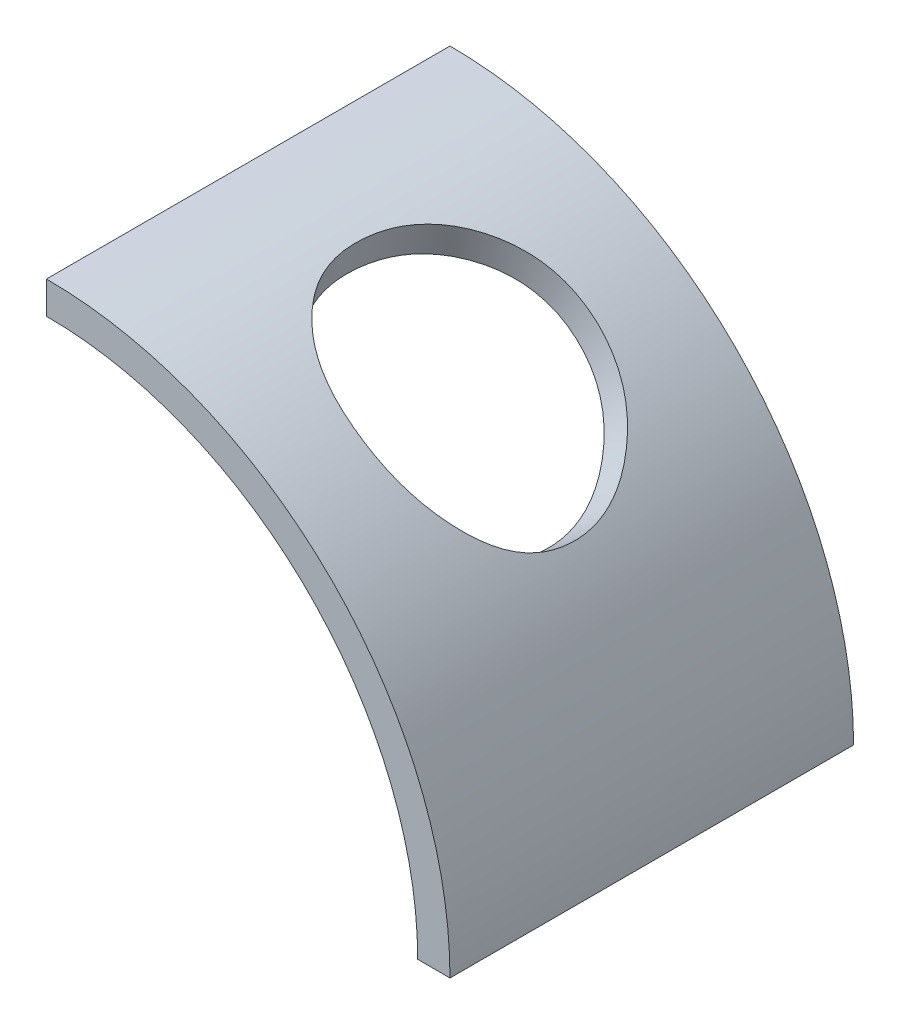
ISO-10303-21;
HEADER;
FILE_DESCRIPTION(('STEP AP214'),'2;1');
FILE_NAME('part.step','',(''),(''),'','','');
FILE_SCHEMA(('AUTOMOTIVE_DESIGN { 1 0 10303 214 1 1 1 1 }'));
ENDSEC;
DATA;
#1=APPLICATION_CONTEXT('core data for automotive mechanical design processes');
#2=APPLICATION_PROTOCOL_DEFINITION('international standard','automotive_design',2000,#1);
#3=PRODUCT_CONTEXT('',#1,'mechanical');
#4=PRODUCT('Part','Part','',(#3));
#5=PRODUCT_RELATED_PRODUCT_CATEGORY('part','',(#4));
#6=PRODUCT_DEFINITION_FORMATION('','',#4);
#7=PRODUCT_DEFINITION_CONTEXT('part definition',#1,'design');
#8=PRODUCT_DEFINITION('design','',#6,#7);
#9=PRODUCT_DEFINITION_SHAPE('','',#8);
#10=(LENGTH_UNIT() NAMED_UNIT(*) SI_UNIT(.MILLI.,.METRE.));
#11=(NAMED_UNIT(*) PLANE_ANGLE_UNIT() SI_UNIT($,.RADIAN.));
#12=(NAMED_UNIT(*) SI_UNIT($,.STERADIAN.) SOLID_ANGLE_UNIT());
#13=UNCERTAINTY_MEASURE_WITH_UNIT(LENGTH_MEASURE(1.E-05),#10,'distance_accuracy_value','');
#14=(GEOMETRIC_REPRESENTATION_CONTEXT(3) GLOBAL_UNCERTAINTY_ASSIGNED_CONTEXT((#13)) GLOBAL_UNIT_ASSIGNED_CONTEXT((#10,
#11,#12)) REPRESENTATION_CONTEXT('',''));
#15=CARTESIAN_POINT('',(0.,0.,0.));
#16=DIRECTION('',(0.,0.,1.));
#17=DIRECTION('',(1.,0.,0.));
#18=AXIS2_PLACEMENT_3D('',#15,#16,#17);
#19=CARTESIAN_POINT('',(0.,0.,12.5));
#20=DIRECTION('',(0.,0.,-1.));
#21=DIRECTION('',(-1.,0.,0.));
#22=AXIS2_PLACEMENT_3D('',#19,#20,#21);
#23=PLANE('',#22);
#24=DIRECTION('',(-1.,0.,0.));
#25=VECTOR('',#24,1.);
#26=CARTESIAN_POINT('',(23.,0.,12.5));
#27=LINE('',#26,#25);
#28=CARTESIAN_POINT('',(25.,0.,12.5));
#29=VERTEX_POINT('',#28);
#30=CARTESIAN_POINT('',(23.,0.,12.5));
#31=VERTEX_POINT('',#30);
#32=EDGE_CURVE('E12',#29,#31,#27,.T.);
#33=ORIENTED_EDGE('',*,*,#32,.F.);
#34=CARTESIAN_POINT('',(0.,0.,12.5));
#35=DIRECTION('',(0.,0.,1.));
#36=DIRECTION('',(1.,0.,0.));
#37=AXIS2_PLACEMENT_3D('',#34,#35,#36);
#38=CIRCLE('',#37,25.);
#39=CARTESIAN_POINT('',(0.,25.,12.5));
#40=VERTEX_POINT('',#39);
#41=EDGE_CURVE('E94',#29,#40,#38,.T.);
#42=ORIENTED_EDGE('',*,*,#41,.T.);
#43=DIRECTION('',(0.,-1.,0.));
#44=VECTOR('',#43,1.);
#45=CARTESIAN_POINT('',(0.,23.,12.5));
#46=LINE('',#45,#44);
#47=CARTESIAN_POINT('',(0.,23.,12.5));
#48=VERTEX_POINT('',#47);
#49=EDGE_CURVE('E68',#40,#48,#46,.T.);
#50=ORIENTED_EDGE('',*,*,#49,.T.);
#51=CARTESIAN_POINT('',(0.,0.,12.5));
#52=DIRECTION('',(0.,0.,1.));
#53=DIRECTION('',(1.,0.,0.));
#54=AXIS2_PLACEMENT_3D('',#51,#52,#53);
#55=CIRCLE('',#54,23.);
#56=EDGE_CURVE('E97',#31,#48,#55,.T.);
#57=ORIENTED_EDGE('',*,*,#56,.F.);
#58=EDGE_LOOP('',(#33,#42,#50,#57));
#59=FACE_BOUND('',#58,.T.);
#60=ADVANCED_FACE('F55',(#59),#23,.F.);
#61=CARTESIAN_POINT('',(0.,23.,0.));
#62=DIRECTION('',(1.,0.,0.));
#63=DIRECTION('',(0.,0.,-1.));
#64=AXIS2_PLACEMENT_3D('',#61,#62,#63);
#65=PLANE('',#64);
#66=ORIENTED_EDGE('',*,*,#49,.F.);
#67=DIRECTION('',(0.,0.,1.));
#68=VECTOR('',#67,1.);
#69=CARTESIAN_POINT('',(0.,25.,-45.281012686853));
#70=LINE('',#69,#68);
#71=CARTESIAN_POINT('',(0.,25.,-12.5));
#72=VERTEX_POINT('',#71);
#73=EDGE_CURVE('E110',#40,#72,#70,.F.);
#74=ORIENTED_EDGE('',*,*,#73,.T.);
#75=DIRECTION('',(0.,-1.,0.));
#76=VECTOR('',#75,1.);
#77=CARTESIAN_POINT('',(0.,23.,-12.5));
#78=LINE('',#77,#76);
#79=CARTESIAN_POINT('',(0.,23.,-12.5));
#80=VERTEX_POINT('',#79);
#81=EDGE_CURVE('E172',#72,#80,#78,.T.);
#82=ORIENTED_EDGE('',*,*,#81,.T.);
#83=DIRECTION('',(0.,0.,-1.));
#84=VECTOR('',#83,1.);
#85=CARTESIAN_POINT('',(0.,23.,12.5));
#86=LINE('',#85,#84);
#87=EDGE_CURVE('E182',#48,#80,#86,.T.);
#88=ORIENTED_EDGE('',*,*,#87,.F.);
#89=EDGE_LOOP('',(#66,#74,#82,#88));
#90=FACE_BOUND('',#89,.T.);
#91=ADVANCED_FACE('F184',(#90),#65,.F.);
#92=CARTESIAN_POINT('',(0.,0.,-12.5));
#93=DIRECTION('',(0.,0.,1.));
#94=DIRECTION('',(1.,0.,0.));
#95=AXIS2_PLACEMENT_3D('',#92,#93,#94);
#96=PLANE('',#95);
#97=ORIENTED_EDGE('',*,*,#81,.F.);
#98=CARTESIAN_POINT('',(0.,0.,-12.5));
#99=DIRECTION('',(0.,0.,1.));
#100=DIRECTION('',(1.,0.,0.));
#101=AXIS2_PLACEMENT_3D('',#98,#99,#100);
#102=CIRCLE('',#101,25.);
#103=CARTESIAN_POINT('',(25.,0.,-12.5));
#104=VERTEX_POINT('',#103);
#105=EDGE_CURVE('E114',#72,#104,#102,.F.);
#106=ORIENTED_EDGE('',*,*,#105,.T.);
#107=DIRECTION('',(-1.,0.,0.));
#108=VECTOR('',#107,1.);
#109=CARTESIAN_POINT('',(23.,0.,-12.5));
#110=LINE('',#109,#108);
#111=CARTESIAN_POINT('',(23.,0.,-12.5));
#112=VERTEX_POINT('',#111);
#113=EDGE_CURVE('E62',#104,#112,#110,.T.);
#114=ORIENTED_EDGE('',*,*,#113,.T.);
#115=CARTESIAN_POINT('',(0.,0.,-12.5));
#116=DIRECTION('',(0.,0.,-1.));
#117=DIRECTION('',(-1.,0.,0.));
#118=AXIS2_PLACEMENT_3D('',#115,#116,#117);
#119=CIRCLE('',#118,23.);
#120=EDGE_CURVE('E185',#80,#112,#119,.T.);
#121=ORIENTED_EDGE('',*,*,#120,.F.);
#122=EDGE_LOOP('',(#97,#106,#114,#121));
#123=FACE_BOUND('',#122,.T.);
#124=ADVANCED_FACE('F147',(#123),#96,.F.);
#125=CARTESIAN_POINT('',(23.,0.,0.));
#126=DIRECTION('',(0.,1.,0.));
#127=DIRECTION('',(0.,0.,1.));
#128=AXIS2_PLACEMENT_3D('',#125,#126,#127);
#129=PLANE('',#128);
#130=DIRECTION('',(0.,0.,1.));
#131=VECTOR('',#130,1.);
#132=CARTESIAN_POINT('',(25.,0.,-45.281012686853));
#133=LINE('',#132,#131);
#134=EDGE_CURVE('E108',#104,#29,#133,.T.);
#135=ORIENTED_EDGE('',*,*,#134,.T.);
#136=ORIENTED_EDGE('',*,*,#32,.T.);
#137=DIRECTION('',(0.,0.,1.));
#138=VECTOR('',#137,1.);
#139=CARTESIAN_POINT('',(23.,0.,-12.5));
#140=LINE('',#139,#138);
#141=EDGE_CURVE('E132',#112,#31,#140,.T.);
#142=ORIENTED_EDGE('',*,*,#141,.F.);
#143=ORIENTED_EDGE('',*,*,#113,.F.);
#144=EDGE_LOOP('',(#135,#136,#142,#143));
#145=FACE_BOUND('',#144,.T.);
#146=ADVANCED_FACE('F112',(#145),#129,.F.);
#147=CARTESIAN_POINT('',(14.5324029710811,20.3423023251084,-6.97359594867605));
#148=CARTESIAN_POINT('',(13.6171464270402,20.9961553997186,-7.05689918053858));
#149=CARTESIAN_POINT('',(12.7181688342533,21.5454044820414,-6.96687013873637));
#150=CARTESIAN_POINT('',(11.4268110265631,22.2411118867976,-6.5718281655359));
#151=CARTESIAN_POINT('',(11.0057579494519,22.4516767666713,-6.39681443938622));
#152=CARTESIAN_POINT('',(10.3913793927701,22.7391811359769,-6.06929424753742));
#153=CARTESIAN_POINT('',(10.1894470004048,22.8302918489884,-5.94928758315044));
#154=CARTESIAN_POINT('',(9.89117222594074,22.9603239528058,-5.7530276859139));
#155=CARTESIAN_POINT('',(9.79251757310995,23.0025622675103,-5.68489940339237));
#156=CARTESIAN_POINT('',(9.64572946022674,23.0643170504288,-5.57864450444606));
#157=CARTESIAN_POINT('',(9.59699904538665,23.0846348583274,-5.54254912560329));
#158=CARTESIAN_POINT('',(9.5242064730089,23.1147178300831,-5.48739043854813));
#159=CARTESIAN_POINT('',(9.49999278921497,23.1246798636457,-5.46883493973124));
#160=CARTESIAN_POINT('',(9.45166718924621,23.1444738357769,-5.43138540250046));
#161=CARTESIAN_POINT('',(9.42871412017121,23.1538353384119,-5.41340952089637));
#162=CARTESIAN_POINT('',(8.59647036190742,23.4916860961716,-4.75402117516418));
#163=CARTESIAN_POINT('',(7.95947135941979,23.7037546314328,-4.02122429646458));
#164=CARTESIAN_POINT('',(7.28663337837444,23.9156907906986,-2.78194398143079));
#165=CARTESIAN_POINT('',(7.10918814198131,23.9682636010024,-2.34550304358879));
#166=CARTESIAN_POINT('',(6.84998736250311,24.0436247104877,-1.42592616891));
#167=CARTESIAN_POINT('',(6.76836725802105,24.0663754144374,-0.944978362389553));
#168=CARTESIAN_POINT('',(6.66741714592465,24.0946141765041,0.581036337562109));
#169=CARTESIAN_POINT('',(6.80443677310016,24.0587672297466,1.52676267154378));
#170=CARTESIAN_POINT('',(7.31192902502816,23.9074643999842,2.83792697353714));
#171=CARTESIAN_POINT('',(7.53128827176363,23.8402886818779,3.2570775410384));
#172=CARTESIAN_POINT('',(7.93353838437449,23.708202917357,3.8589470925455));
#173=CARTESIAN_POINT('',(8.07981119989351,23.6589248989157,4.05509422642373));
#174=CARTESIAN_POINT('',(8.31711365232332,23.5761031469145,4.34260085230489));
#175=CARTESIAN_POINT('',(8.39919566295509,23.5470100493331,4.43731738177591));
#176=CARTESIAN_POINT('',(8.52673178106367,23.500997588311,4.57771365724839));
#177=CARTESIAN_POINT('',(8.569979265377,23.4852645281991,4.62423266261687));
#178=CARTESIAN_POINT('',(8.63594565039204,23.4610526482849,4.69359154098609));
#179=CARTESIAN_POINT('',(8.65811696701721,23.4528799669971,4.71664122882857));
#180=CARTESIAN_POINT('',(8.70282325000369,23.436327264316,4.76260072795237));
#181=CARTESIAN_POINT('',(8.7261911868384,23.4276360962494,4.78634804922074));
#182=CARTESIAN_POINT('',(9.44833361921423,23.157887983718,5.51242602867239));
#183=CARTESIAN_POINT('',(10.2263417687269,22.8320023391806,6.04688563701226));
#184=CARTESIAN_POINT('',(11.4869392470821,22.2096786543758,6.59415103737493));
#185=CARTESIAN_POINT('',(11.9226192454505,21.9799328751495,6.73416883547128));
#186=CARTESIAN_POINT('',(12.5952661940782,21.5968943187979,6.88058952957904));
#187=CARTESIAN_POINT('',(12.8226603424915,21.462810060007,6.91879542710883));
#188=CARTESIAN_POINT('',(13.1679186170445,21.2514500158837,6.96020277264431));
#189=CARTESIAN_POINT('',(13.2836985729773,21.1792910520254,6.97135497102962));
#190=CARTESIAN_POINT('',(13.4583282703693,21.0684160410318,6.98410789341776));
#191=CARTESIAN_POINT('',(13.5166980879923,21.0310182790028,6.9876963050155));
#192=CARTESIAN_POINT('',(13.6044821797544,20.9742527610441,6.99208507861468));
#193=CARTESIAN_POINT('',(13.6337817685441,20.9552194428246,6.99338236251484));
#194=CARTESIAN_POINT('',(13.6924556113827,20.9169282290573,6.99564564904932));
#195=CARTESIAN_POINT('',(13.7229242101498,20.896949556528,6.99664143242382));
#196=CARTESIAN_POINT('',(14.6573633920078,20.2814924372296,7.02207061404521));
#197=CARTESIAN_POINT('',(15.4785007583409,19.6562219257797,6.89062245971431));
#198=CARTESIAN_POINT('',(16.5916207609267,18.7071077950588,6.45929009618139));
#199=CARTESIAN_POINT('',(16.9429502519969,18.3888059563085,6.27648595299766));
#200=CARTESIAN_POINT('',(17.4418790953811,17.9118338133539,5.94373970521293));
#201=CARTESIAN_POINT('',(17.6035133316693,17.7529193331165,5.82306761711649));
#202=CARTESIAN_POINT('',(17.8391561798761,17.5150496261526,5.62742447671955));
#203=CARTESIAN_POINT('',(17.9165691486964,17.4358431564532,5.55977092854519));
#204=CARTESIAN_POINT('',(18.0310130569116,17.3172049505859,5.45463185422058));
#205=CARTESIAN_POINT('',(18.0688817743344,17.2776874505386,5.41897570410187));
#206=CARTESIAN_POINT('',(18.1252693230408,17.218459716844,5.36457679090802));
#207=CARTESIAN_POINT('',(18.1439959183541,17.1987252241078,5.34629137184078));
#208=CARTESIAN_POINT('',(18.1719823515283,17.1691363126002,5.31863457123597));
#209=CARTESIAN_POINT('',(18.1812939193059,17.1592754799745,5.30937752570039));
#210=CARTESIAN_POINT('',(18.1998826387878,17.1395582064472,5.29078721062789));
#211=CARTESIAN_POINT('',(18.2083896474431,17.1305213282951,5.28223334937727));
#212=CARTESIAN_POINT('',(18.8603475796305,16.4367275765501,4.62243201082648));
#213=CARTESIAN_POINT('',(19.3180035904614,15.8767729963862,3.89462840744739));
#214=CARTESIAN_POINT('',(19.7889837073609,15.279411628226,2.68569342040054));
#215=CARTESIAN_POINT('',(19.9097746335478,15.1202575927975,2.26317682772188));
#216=CARTESIAN_POINT('',(20.0412039272863,14.9450819352965,1.60009454320933));
#217=CARTESIAN_POINT('',(20.0766969719145,14.897260305074,1.37418254912272));
#218=CARTESIAN_POINT('',(20.1178069006532,14.8416433383515,1.02798770911917));
#219=CARTESIAN_POINT('',(20.1294870140413,14.8257889923399,0.911368287639043));
#220=CARTESIAN_POINT('',(20.1440011111627,14.8060557174062,0.734607443200447));
#221=CARTESIAN_POINT('',(20.1483380301738,14.8001525894967,0.675381876351193));
#222=CARTESIAN_POINT('',(20.1560132096458,14.7896982235311,0.556320171913189));
#223=CARTESIAN_POINT('',(20.1592964613409,14.7852220194261,0.497648806202303));
#224=CARTESIAN_POINT('',(20.2085168371144,14.718083642668,-0.544556506015325));
#225=CARTESIAN_POINT('',(20.1198087064219,14.8439355012334,-1.46396851348571));
#226=CARTESIAN_POINT('',(19.7687589933903,15.3046871496347,-2.75085585982493));
#227=CARTESIAN_POINT('',(19.6149179928279,15.5032449493721,-3.16444653112694));
#228=CARTESIAN_POINT('',(19.3228346632967,15.8635419604607,-3.76177487186337));
#229=CARTESIAN_POINT('',(19.2152259971676,15.9940242846309,-3.95704137440608));
#230=CARTESIAN_POINT('',(19.0374537017753,16.2044372715518,-4.244176711666));
#231=CARTESIAN_POINT('',(18.9754682407001,16.2770212667265,-4.33892775466028));
#232=CARTESIAN_POINT('',(18.8782619218299,16.3894380891661,-4.47961321501316));
#233=CARTESIAN_POINT('',(18.8451550442276,16.4275003727378,-4.52626818444104));
#234=CARTESIAN_POINT('',(18.7944198352926,16.485461544618,-4.59589036254821));
#235=CARTESIAN_POINT('',(18.7773289453298,16.5049265513124,-4.61903770924483));
#236=CARTESIAN_POINT('',(18.7514216197536,16.5343387510529,-4.6536686602811));
#237=CARTESIAN_POINT('',(18.7427406791608,16.5441785987179,-4.66519729912508));
#238=CARTESIAN_POINT('',(18.7252880869723,16.5639294774047,-4.68822455381015));
#239=CARTESIAN_POINT('',(18.7157711612577,16.5746812310018,-4.70069382186468));
#240=CARTESIAN_POINT('',(18.1910960860893,17.166552287907,-5.38403571006922));
#241=CARTESIAN_POINT('',(17.5943254337666,17.7853895171224,-5.90898260933214));
#242=CARTESIAN_POINT('',(16.5573517598652,18.7369739989239,-6.47457990300342));
#243=CARTESIAN_POINT('',(16.1880630842098,19.0579566022326,-6.62614182502333));
#244=CARTESIAN_POINT('',(15.5961950576263,19.5403038306012,-6.79802894424743));
#245=CARTESIAN_POINT('',(15.3925855115747,19.7012248099654,-6.84608202335451));
#246=CARTESIAN_POINT('',(15.0774062702437,19.9421490090211,-6.90429770106367));
#247=CARTESIAN_POINT('',(14.970719251554,20.0223804121802,-6.92139227014147));
#248=CARTESIAN_POINT('',(14.8082143734856,20.1425252919941,-6.94356813852033));
#249=CARTESIAN_POINT('',(14.7536337050032,20.1825398525749,-6.95038243044031));
#250=CARTESIAN_POINT('',(14.6436422416473,20.2624866267895,-6.96285568586764));
#251=CARTESIAN_POINT('',(14.5896065050837,20.3014365079453,-6.96838949668464));
#252=CARTESIAN_POINT('',(14.5324029710811,20.3423023251084,-6.97359594867605));
#253=CARTESIAN_POINT('',(13.3698107333946,18.7149181390998,-6.97359594867605));
#254=CARTESIAN_POINT('',(12.527774712877,19.3164629677411,-7.05689918053859));
#255=CARTESIAN_POINT('',(11.700715327513,19.8217721234781,-6.96687013873637));
#256=CARTESIAN_POINT('',(10.512666144438,20.4618229358538,-6.57182816553591));
#257=CARTESIAN_POINT('',(10.1252973134958,20.6555426253376,-6.39681443938622));
#258=CARTESIAN_POINT('',(9.56006904134848,20.9200466450987,-6.06929424753742));
#259=CARTESIAN_POINT('',(9.37429124037241,21.0038685010694,-5.94928758315044));
#260=CARTESIAN_POINT('',(9.09987844786549,21.1234980365814,-5.7530276859139));
#261=CARTESIAN_POINT('',(9.00911616726116,21.1623572861094,-5.68489940339237));
#262=CARTESIAN_POINT('',(8.8740711034086,21.2191716863945,-5.57864450444606));
#263=CARTESIAN_POINT('',(8.82923912175571,21.2378640696612,-5.54254912560329));
#264=CARTESIAN_POINT('',(8.76226995516819,21.2655404036764,-5.48739043854813));
#265=CARTESIAN_POINT('',(8.73999336607777,21.274705474554,-5.46883493973124));
#266=CARTESIAN_POINT('',(8.69553381410651,21.2929159289148,-5.43138540250046));
#267=CARTESIAN_POINT('',(8.67441699055751,21.3015285113389,-5.41340952089637));
#268=CARTESIAN_POINT('',(7.90875273295483,21.6123512084779,-4.75402117516418));
#269=CARTESIAN_POINT('',(7.3227136506662,21.8074542609182,-4.02122429646458));
#270=CARTESIAN_POINT('',(6.70370270810448,22.0024355274428,-2.78194398143079));
#271=CARTESIAN_POINT('',(6.54045309062281,22.0508025129222,-2.34550304358879));
#272=CARTESIAN_POINT('',(6.30198837350286,22.1201347336487,-1.42592616891));
#273=CARTESIAN_POINT('',(6.22689787737937,22.1410653812824,-0.944978362389554));
#274=CARTESIAN_POINT('',(6.13402377425067,22.1670450423838,0.581036337562108));
#275=CARTESIAN_POINT('',(6.26008183125215,22.1340658513669,1.52676267154378));
#276=CARTESIAN_POINT('',(6.7269747030259,21.9948672479855,2.83792697353714));
#277=CARTESIAN_POINT('',(6.92878521002254,21.9330655873277,3.2570775410384));
#278=CARTESIAN_POINT('',(7.29885531362453,21.8115466839685,3.8589470925455));
#279=CARTESIAN_POINT('',(7.43342630390203,21.7662109070025,4.05509422642373));
#280=CARTESIAN_POINT('',(7.65174456013746,21.6900148951613,4.34260085230489));
#281=CARTESIAN_POINT('',(7.72726000991868,21.6632492453864,4.43731738177591));
#282=CARTESIAN_POINT('',(7.84459323857857,21.6209177812461,4.57771365724839));
#283=CARTESIAN_POINT('',(7.88438092414684,21.6064433659432,4.62423266261687));
#284=CARTESIAN_POINT('',(7.94506999836068,21.5841684364221,4.69359154098609));
#285=CARTESIAN_POINT('',(7.96546760965583,21.5766495696373,4.71664122882857));
#286=CARTESIAN_POINT('',(8.00659739000339,21.5614210831707,4.76260072795237));
#287=CARTESIAN_POINT('',(8.02809589189132,21.5534252085495,4.78634804922074));
#288=CARTESIAN_POINT('',(8.69246692967709,21.3052569450206,5.51242602867239));
#289=CARTESIAN_POINT('',(9.40823442722878,21.0054421520461,6.04688563701226));
#290=CARTESIAN_POINT('',(10.5679841073155,20.4329043620257,6.59415103737493));
#291=CARTESIAN_POINT('',(10.9688097058145,20.2215382451376,6.73416883547128));
#292=CARTESIAN_POINT('',(11.587644898552,19.8691427732941,6.88058952957904));
#293=CARTESIAN_POINT('',(11.7968475150922,19.7457852552065,6.91879542710883));
#294=CARTESIAN_POINT('',(12.1144851276809,19.551334014613,6.96020277264431));
#295=CARTESIAN_POINT('',(12.2210026871391,19.4849477678633,6.97135497102962));
#296=CARTESIAN_POINT('',(12.3816620087398,19.3829427577493,6.98410789341776));
#297=CARTESIAN_POINT('',(12.4353622409529,19.3485368166826,6.9876963050155));
#298=CARTESIAN_POINT('',(12.5161236053741,19.2963125401605,6.99208507861468));
#299=CARTESIAN_POINT('',(12.5430792270605,19.2788018873987,6.99338236251484));
#300=CARTESIAN_POINT('',(12.5970591624721,19.2435739707327,6.99564564904932));
#301=CARTESIAN_POINT('',(12.6250902733378,19.2251935920058,6.99664143242381));
#302=CARTESIAN_POINT('',(13.4847743206472,18.6589730422512,7.02207061404521));
#303=CARTESIAN_POINT('',(14.2402206976736,18.0837241717173,6.8906224597143));
#304=CARTESIAN_POINT('',(15.2642911000526,17.2105391714541,6.45929009618139));
#305=CARTESIAN_POINT('',(15.5875142318371,16.9177014798038,6.27648595299766));
#306=CARTESIAN_POINT('',(16.0465287677506,16.4788871082856,5.94373970521293));
#307=CARTESIAN_POINT('',(16.1952322651358,16.3326857864671,5.82306761711649));
#308=CARTESIAN_POINT('',(16.412023685486,16.1138456560604,5.62742447671955));
#309=CARTESIAN_POINT('',(16.4832436168006,16.0409757039369,5.55977092854519));
#310=CARTESIAN_POINT('',(16.5885320123587,15.931828554539,5.45463185422058));
#311=CARTESIAN_POINT('',(16.6233712323876,15.8954724544955,5.41897570410186));
#312=CARTESIAN_POINT('',(16.6752477771975,15.8409829394965,5.36457679090802));
#313=CARTESIAN_POINT('',(16.6924762448858,15.8228272061792,5.34629137184078));
#314=CARTESIAN_POINT('',(16.718223763406,15.7956054075922,5.31863457123597));
#315=CARTESIAN_POINT('',(16.7267904057614,15.7865334415765,5.30937752570039));
#316=CARTESIAN_POINT('',(16.7438920276848,15.7683935499314,5.29078721062789));
#317=CARTESIAN_POINT('',(16.7517184756476,15.7600796220315,5.28223334937727));
#318=CARTESIAN_POINT('',(17.35151977326,15.1217893704261,4.62243201082648));
#319=CARTESIAN_POINT('',(17.7725633032245,14.6066311566753,3.89462840744739));
#320=CARTESIAN_POINT('',(18.2058650107721,14.0570586979679,2.68569342040054));
#321=CARTESIAN_POINT('',(18.316992662864,13.9106369853737,2.26317682772188));
#322=CARTESIAN_POINT('',(18.4379076131034,13.7494753804728,1.60009454320933));
#323=CARTESIAN_POINT('',(18.4705612141613,13.705479480668,1.37418254912272));
#324=CARTESIAN_POINT('',(18.5083823486009,13.6543118712834,1.02798770911917));
#325=CARTESIAN_POINT('',(18.519128052918,13.6397258729527,0.911368287639042));
#326=CARTESIAN_POINT('',(18.5324810222697,13.6215712600137,0.734607443200446));
#327=CARTESIAN_POINT('',(18.5364709877599,13.616140382337,0.675381876351191));
#328=CARTESIAN_POINT('',(18.5435321528742,13.6065223656486,0.556320171913188));
#329=CARTESIAN_POINT('',(18.5465527444336,13.602404257872,0.497648806202302));
#330=CARTESIAN_POINT('',(18.5918354901452,13.5406369512546,-0.544556506015326));
#331=CARTESIAN_POINT('',(18.5102240099082,13.6564206611347,-1.46396851348571));
#332=CARTESIAN_POINT('',(18.1872582739191,14.080312177664,-2.75085585982493));
#333=CARTESIAN_POINT('',(18.0457245534017,14.2629853534223,-3.16444653112694));
#334=CARTESIAN_POINT('',(17.777007890233,14.5944586036238,-3.76177487186337));
#335=CARTESIAN_POINT('',(17.6780079173942,14.7145023418604,-3.95704137440609));
#336=CARTESIAN_POINT('',(17.5144574056333,14.9080822898277,-4.24417671166601));
#337=CARTESIAN_POINT('',(17.4574307814441,14.9748595653884,-4.33892775466028));
#338=CARTESIAN_POINT('',(17.3680009680835,15.0782830420328,-4.47961321501316));
#339=CARTESIAN_POINT('',(17.3375426406894,15.1133003429187,-4.52626818444104));
#340=CARTESIAN_POINT('',(17.2908662484692,15.1666246210485,-4.59589036254821));
#341=CARTESIAN_POINT('',(17.2751426297034,15.1845324272074,-4.61903770924483));
#342=CARTESIAN_POINT('',(17.2513078901733,15.2115916509687,-4.65366866028111));
#343=CARTESIAN_POINT('',(17.2433214248279,15.2206443108205,-4.66519729912508));
#344=CARTESIAN_POINT('',(17.2272650400145,15.2388151192124,-4.68822455381016));
#345=CARTESIAN_POINT('',(17.2185094683571,15.2487067325216,-4.70069382186468));
#346=CARTESIAN_POINT('',(16.7358083992021,15.7932281048745,-5.38403571006922));
#347=CARTESIAN_POINT('',(16.1867793990653,16.3625583557526,-5.90898260933214));
#348=CARTESIAN_POINT('',(15.232763619076,17.23801607901,-6.47457990300342));
#349=CARTESIAN_POINT('',(14.893018037473,17.5333200740539,-6.62614182502334));
#350=CARTESIAN_POINT('',(14.3484994530162,17.9770795241531,-6.79802894424743));
#351=CARTESIAN_POINT('',(14.1611786706487,18.1251268251682,-6.84608202335451));
#352=CARTESIAN_POINT('',(13.8712137686242,18.3467770882994,-6.90429770106367));
#353=CARTESIAN_POINT('',(13.7730617114297,18.4205899792058,-6.92139227014147));
#354=CARTESIAN_POINT('',(13.6235572236067,18.5311232686345,-6.94356813852033));
#355=CARTESIAN_POINT('',(13.5733430086029,18.5679366643689,-6.95038243044031));
#356=CARTESIAN_POINT('',(13.4721508623155,18.6414876966463,-6.96285568586765));
#357=CARTESIAN_POINT('',(13.422437984677,18.6773215873097,-6.96838949668464));
#358=CARTESIAN_POINT('',(13.3698107333946,18.7149181390998,-6.97359594867605));
#359=B_SPLINE_SURFACE_WITH_KNOTS('',1,3,((#147,#148,#149,#150,#151,#152,#153,#154,#155,#156,
#157,#158,#159,#160,#161,#162,#163,#164,#165,#166,#167,#168,#169,#170,#171,#172,#173,#174,#175,
#176,#177,#178,#179,#180,#181,#182,#183,#184,#185,#186,#187,#188,#189,#190,#191,#192,#193,#194,
#195,#196,#197,#198,#199,#200,#201,#202,#203,#204,#205,#206,#207,#208,#209,#210,#211,#212,#213,
#214,#215,#216,#217,#218,#219,#220,#221,#222,#223,#224,#225,#226,#227,#228,#229,#230,#231,#232,
#233,#234,#235,#236,#237,#238,#239,#240,#241,#242,#243,#244,#245,#246,#247,#248,#249,#250,#251,
#252),(#253,#254,#255,#256,#257,#258,#259,#260,#261,#262,#263,#264,#265,#266,#267,#268,#269,
#270,#271,#272,#273,#274,#275,#276,#277,#278,#279,#280,#281,#282,#283,#284,#285,#286,#287,#288,
#289,#290,#291,#292,#293,#294,#295,#296,#297,#298,#299,#300,#301,#302,#303,#304,#305,#306,#307,
#308,#309,#310,#311,#312,#313,#314,#315,#316,#317,#318,#319,#320,#321,#322,#323,#324,#325,#326,
#327,#328,#329,#330,#331,#332,#333,#334,#335,#336,#337,#338,#339,#340,#341,#342,#343,#344,#345,
#346,#347,#348,#349,#350,#351,#352,#353,#354,#355,#356,#357,#358)),.UNSPECIFIED.,.F.,.T.,.F.,(2,
2),(4,2,2,2,2,2,2,2,2,2,2,2,2,2,2,2,2,2,2,2,2,2,2,2,2,2,2,2,2,2,2,2,2,2,2,2,2,2,2,2,2,2,2,2,2,2,
2,2,2,2,2,2,4),(0.,1.),(0.,0.0625,0.09375,0.109375,0.1171875,0.12109375,0.123046875,0.125,
0.1875,0.21875,0.25,0.3125,0.34375,0.359375,0.3671875,0.37109375,0.373046875,0.375,0.4375,
0.46875,0.484375,0.4921875,0.49609375,0.498046875,0.5,0.5625,0.59375,0.609375,0.6171875,
0.62109375,0.623046875,0.6240234375,0.625,0.6875,0.71875,0.734375,0.7421875,0.74609375,0.75,
0.8125,0.84375,0.859375,0.8671875,0.87109375,0.873046875,0.8740234375,0.875,0.9375,0.96875,
0.984375,0.9921875,0.99609375,1.),.UNSPECIFIED.);
#360=CARTESIAN_POINT('',(13.3698107333946,18.7149181390998,-6.97359594867605));
#361=CARTESIAN_POINT('',(13.422437984677,18.6773215873097,-6.96838949668464));
#362=CARTESIAN_POINT('',(13.4721508623155,18.6414876966463,-6.96285568586765));
#363=CARTESIAN_POINT('',(13.5733430086029,18.5679366643689,-6.95038243044031));
#364=CARTESIAN_POINT('',(13.6235572236067,18.5311232686345,-6.94356813852033));
#365=CARTESIAN_POINT('',(13.7730617114297,18.4205899792058,-6.92139227014147));
#366=CARTESIAN_POINT('',(13.8712137686242,18.3467770882994,-6.90429770106367));
#367=CARTESIAN_POINT('',(14.1611786706487,18.1251268251682,-6.84608202335451));
#368=CARTESIAN_POINT('',(14.3484994530162,17.9770795241531,-6.79802894424743));
#369=CARTESIAN_POINT('',(14.893018037473,17.5333200740539,-6.62614182502334));
#370=CARTESIAN_POINT('',(15.232763619076,17.23801607901,-6.47457990300342));
#371=CARTESIAN_POINT('',(16.1867793990653,16.3625583557526,-5.90898260933214));
#372=CARTESIAN_POINT('',(16.7358083992021,15.7932281048745,-5.38403571006922));
#373=CARTESIAN_POINT('',(17.2185094683571,15.2487067325216,-4.70069382186468));
#374=CARTESIAN_POINT('',(17.2272650400145,15.2388151192124,-4.68822455381016));
#375=CARTESIAN_POINT('',(17.2433214248279,15.2206443108205,-4.66519729912508));
#376=CARTESIAN_POINT('',(17.2513078901733,15.2115916509687,-4.65366866028111));
#377=CARTESIAN_POINT('',(17.2751426297034,15.1845324272074,-4.61903770924483));
#378=CARTESIAN_POINT('',(17.2908662484692,15.1666246210485,-4.59589036254821));
#379=CARTESIAN_POINT('',(17.3375426406894,15.1133003429187,-4.52626818444104));
#380=CARTESIAN_POINT('',(17.3680009680835,15.0782830420328,-4.47961321501316));
#381=CARTESIAN_POINT('',(17.4574307814441,14.9748595653884,-4.33892775466028));
#382=CARTESIAN_POINT('',(17.5144574056333,14.9080822898277,-4.24417671166601));
#383=CARTESIAN_POINT('',(17.6780079173942,14.7145023418604,-3.95704137440609));
#384=CARTESIAN_POINT('',(17.777007890233,14.5944586036238,-3.76177487186337));
#385=CARTESIAN_POINT('',(18.0457245534017,14.2629853534223,-3.16444653112694));
#386=CARTESIAN_POINT('',(18.1872582739191,14.080312177664,-2.75085585982493));
#387=CARTESIAN_POINT('',(18.5102240099082,13.6564206611347,-1.46396851348571));
#388=CARTESIAN_POINT('',(18.5918354901452,13.5406369512546,-0.544556506015326));
#389=CARTESIAN_POINT('',(18.5465527444336,13.602404257872,0.497648806202302));
#390=CARTESIAN_POINT('',(18.5435321528742,13.6065223656486,0.556320171913188));
#391=CARTESIAN_POINT('',(18.5364709877599,13.616140382337,0.675381876351191));
#392=CARTESIAN_POINT('',(18.5324810222697,13.6215712600137,0.734607443200446));
#393=CARTESIAN_POINT('',(18.519128052918,13.6397258729527,0.911368287639042));
#394=CARTESIAN_POINT('',(18.5083823486009,13.6543118712834,1.02798770911917));
#395=CARTESIAN_POINT('',(18.4705612141613,13.705479480668,1.37418254912272));
#396=CARTESIAN_POINT('',(18.4379076131034,13.7494753804728,1.60009454320933));
#397=CARTESIAN_POINT('',(18.316992662864,13.9106369853737,2.26317682772188));
#398=CARTESIAN_POINT('',(18.2058650107721,14.0570586979679,2.68569342040054));
#399=CARTESIAN_POINT('',(17.7725633032245,14.6066311566753,3.89462840744739));
#400=CARTESIAN_POINT('',(17.35151977326,15.1217893704261,4.62243201082648));
#401=CARTESIAN_POINT('',(16.7517184756476,15.7600796220315,5.28223334937727));
#402=CARTESIAN_POINT('',(16.7438920276848,15.7683935499314,5.29078721062789));
#403=CARTESIAN_POINT('',(16.7267904057614,15.7865334415765,5.30937752570039));
#404=CARTESIAN_POINT('',(16.718223763406,15.7956054075922,5.31863457123597));
#405=CARTESIAN_POINT('',(16.6924762448858,15.8228272061792,5.34629137184078));
#406=CARTESIAN_POINT('',(16.6752477771975,15.8409829394965,5.36457679090802));
#407=CARTESIAN_POINT('',(16.6233712323876,15.8954724544955,5.41897570410186));
#408=CARTESIAN_POINT('',(16.5885320123587,15.931828554539,5.45463185422058));
#409=CARTESIAN_POINT('',(16.4832436168006,16.0409757039369,5.55977092854519));
#410=CARTESIAN_POINT('',(16.412023685486,16.1138456560604,5.62742447671955));
#411=CARTESIAN_POINT('',(16.1952322651358,16.3326857864671,5.82306761711649));
#412=CARTESIAN_POINT('',(16.0465287677506,16.4788871082856,5.94373970521293));
#413=CARTESIAN_POINT('',(15.5875142318371,16.9177014798038,6.27648595299766));
#414=CARTESIAN_POINT('',(15.2642911000526,17.2105391714541,6.45929009618139));
#415=CARTESIAN_POINT('',(14.2402206976736,18.0837241717173,6.8906224597143));
#416=CARTESIAN_POINT('',(13.4847743206472,18.6589730422512,7.02207061404521));
#417=CARTESIAN_POINT('',(12.6250902733378,19.2251935920058,6.99664143242381));
#418=CARTESIAN_POINT('',(12.5970591624721,19.2435739707327,6.99564564904932));
#419=CARTESIAN_POINT('',(12.5430792270605,19.2788018873987,6.99338236251484));
#420=CARTESIAN_POINT('',(12.5161236053741,19.2963125401605,6.99208507861468));
#421=CARTESIAN_POINT('',(12.4353622409529,19.3485368166826,6.9876963050155));
#422=CARTESIAN_POINT('',(12.3816620087398,19.3829427577493,6.98410789341776));
#423=CARTESIAN_POINT('',(12.2210026871391,19.4849477678633,6.97135497102962));
#424=CARTESIAN_POINT('',(12.1144851276809,19.551334014613,6.96020277264431));
#425=CARTESIAN_POINT('',(11.7968475150922,19.7457852552065,6.91879542710883));
#426=CARTESIAN_POINT('',(11.587644898552,19.8691427732941,6.88058952957904));
#427=CARTESIAN_POINT('',(10.9688097058145,20.2215382451376,6.73416883547128));
#428=CARTESIAN_POINT('',(10.5679841073155,20.4329043620257,6.59415103737493));
#429=CARTESIAN_POINT('',(9.40823442722878,21.0054421520461,6.04688563701226));
#430=CARTESIAN_POINT('',(8.69246692967709,21.3052569450206,5.51242602867239));
#431=CARTESIAN_POINT('',(8.02809589189132,21.5534252085495,4.78634804922074));
#432=CARTESIAN_POINT('',(8.00659739000339,21.5614210831707,4.76260072795237));
#433=CARTESIAN_POINT('',(7.96546760965583,21.5766495696373,4.71664122882857));
#434=CARTESIAN_POINT('',(7.94506999836068,21.5841684364221,4.69359154098609));
#435=CARTESIAN_POINT('',(7.88438092414684,21.6064433659432,4.62423266261687));
#436=CARTESIAN_POINT('',(7.84459323857857,21.6209177812461,4.57771365724839));
#437=CARTESIAN_POINT('',(7.72726000991868,21.6632492453864,4.43731738177591));
#438=CARTESIAN_POINT('',(7.65174456013746,21.6900148951613,4.34260085230489));
#439=CARTESIAN_POINT('',(7.43342630390203,21.7662109070025,4.05509422642373));
#440=CARTESIAN_POINT('',(7.29885531362453,21.8115466839685,3.8589470925455));
#441=CARTESIAN_POINT('',(6.92878521002254,21.9330655873277,3.2570775410384));
#442=CARTESIAN_POINT('',(6.7269747030259,21.9948672479855,2.83792697353714));
#443=CARTESIAN_POINT('',(6.26008183125215,22.1340658513669,1.52676267154378));
#444=CARTESIAN_POINT('',(6.13402377425067,22.1670450423838,0.581036337562108));
#445=CARTESIAN_POINT('',(6.22689787737937,22.1410653812824,-0.944978362389554));
#446=CARTESIAN_POINT('',(6.30198837350286,22.1201347336487,-1.42592616891));
#447=CARTESIAN_POINT('',(6.54045309062281,22.0508025129222,-2.34550304358879));
#448=CARTESIAN_POINT('',(6.70370270810448,22.0024355274428,-2.78194398143079));
#449=CARTESIAN_POINT('',(7.3227136506662,21.8074542609182,-4.02122429646458));
#450=CARTESIAN_POINT('',(7.90875273295483,21.6123512084779,-4.75402117516418));
#451=CARTESIAN_POINT('',(8.67441699055751,21.3015285113389,-5.41340952089637));
#452=CARTESIAN_POINT('',(8.69553381410651,21.2929159289148,-5.43138540250046));
#453=CARTESIAN_POINT('',(8.73999336607777,21.274705474554,-5.46883493973124));
#454=CARTESIAN_POINT('',(8.76226995516819,21.2655404036764,-5.48739043854813));
#455=CARTESIAN_POINT('',(8.82923912175571,21.2378640696612,-5.54254912560329));
#456=CARTESIAN_POINT('',(8.8740711034086,21.2191716863945,-5.57864450444606));
#457=CARTESIAN_POINT('',(9.00911616726116,21.1623572861094,-5.68489940339237));
#458=CARTESIAN_POINT('',(9.09987844786549,21.1234980365814,-5.7530276859139));
#459=CARTESIAN_POINT('',(9.37429124037241,21.0038685010694,-5.94928758315044));
#460=CARTESIAN_POINT('',(9.56006904134848,20.9200466450987,-6.06929424753742));
#461=CARTESIAN_POINT('',(10.1252973134958,20.6555426253376,-6.39681443938622));
#462=CARTESIAN_POINT('',(10.512666144438,20.4618229358538,-6.57182816553591));
#463=CARTESIAN_POINT('',(11.700715327513,19.8217721234781,-6.96687013873637));
#464=CARTESIAN_POINT('',(12.527774712877,19.3164629677411,-7.05689918053859));
#465=CARTESIAN_POINT('',(13.3698107333946,18.7149181390998,-6.97359594867605));
#466=B_SPLINE_CURVE_WITH_KNOTS('',3,(#360,#361,#362,#363,#364,#365,#366,#367,#368,#369,#370,
#371,#372,#373,#374,#375,#376,#377,#378,#379,#380,#381,#382,#383,#384,#385,#386,#387,#388,#389,
#390,#391,#392,#393,#394,#395,#396,#397,#398,#399,#400,#401,#402,#403,#404,#405,#406,#407,#408,
#409,#410,#411,#412,#413,#414,#415,#416,#417,#418,#419,#420,#421,#422,#423,#424,#425,#426,#427,
#428,#429,#430,#431,#432,#433,#434,#435,#436,#437,#438,#439,#440,#441,#442,#443,#444,#445,#446,
#447,#448,#449,#450,#451,#452,#453,#454,#455,#456,#457,#458,#459,#460,#461,#462,#463,#464,#465),
.UNSPECIFIED.,.T.,.F.,(4,2,2,2,2,2,2,2,2,2,2,2,2,2,2,2,2,2,2,2,2,2,2,2,2,2,2,2,2,2,2,2,2,2,2,2,
2,2,2,2,2,2,2,2,2,2,2,2,2,2,2,2,4),(0.,0.00390625,0.0078125,0.015625,0.03125,0.0625,0.125,
0.1259765625,0.126953125,0.12890625,0.1328125,0.140625,0.15625,0.1875,0.25,0.25390625,0.2578125,
0.265625,0.28125,0.3125,0.375,0.3759765625,0.376953125,0.37890625,0.3828125,0.390625,0.40625,
0.4375,0.5,0.501953125,0.50390625,0.5078125,0.515625,0.53125,0.5625,0.625,0.626953125,
0.62890625,0.6328125,0.640625,0.65625,0.6875,0.75,0.78125,0.8125,0.875,0.876953125,0.87890625,
0.8828125,0.890625,0.90625,0.9375,1.),.UNSPECIFIED.);
#467=CARTESIAN_POINT('',(13.3698107333946,18.7149181390998,-6.97359594867605));
#468=VERTEX_POINT('',#467);
#469=EDGE_CURVE('E125',#468,#468,#466,.F.);
#470=CARTESIAN_POINT('',(14.5324029710811,20.3423023251084,-6.97359594867605));
#471=CARTESIAN_POINT('',(13.6171464270402,20.9961553997186,-7.05689918053858));
#472=CARTESIAN_POINT('',(12.7181688342533,21.5454044820414,-6.96687013873637));
#473=CARTESIAN_POINT('',(11.4268110265631,22.2411118867976,-6.5718281655359));
#474=CARTESIAN_POINT('',(11.0057579494519,22.4516767666713,-6.39681443938622));
#475=CARTESIAN_POINT('',(10.3913793927701,22.7391811359769,-6.06929424753742));
#476=CARTESIAN_POINT('',(10.1894470004048,22.8302918489884,-5.94928758315044));
#477=CARTESIAN_POINT('',(9.89117222594074,22.9603239528058,-5.7530276859139));
#478=CARTESIAN_POINT('',(9.79251757310995,23.0025622675103,-5.68489940339237));
#479=CARTESIAN_POINT('',(9.64572946022674,23.0643170504288,-5.57864450444606));
#480=CARTESIAN_POINT('',(9.59699904538665,23.0846348583274,-5.54254912560329));
#481=CARTESIAN_POINT('',(9.5242064730089,23.1147178300831,-5.48739043854813));
#482=CARTESIAN_POINT('',(9.49999278921497,23.1246798636457,-5.46883493973124));
#483=CARTESIAN_POINT('',(9.45166718924621,23.1444738357769,-5.43138540250046));
#484=CARTESIAN_POINT('',(9.42871412017121,23.1538353384119,-5.41340952089637));
#485=CARTESIAN_POINT('',(8.59647036190742,23.4916860961716,-4.75402117516418));
#486=CARTESIAN_POINT('',(7.95947135941979,23.7037546314328,-4.02122429646458));
#487=CARTESIAN_POINT('',(7.28663337837444,23.9156907906986,-2.78194398143079));
#488=CARTESIAN_POINT('',(7.10918814198131,23.9682636010024,-2.34550304358879));
#489=CARTESIAN_POINT('',(6.84998736250311,24.0436247104877,-1.42592616891));
#490=CARTESIAN_POINT('',(6.76836725802105,24.0663754144374,-0.944978362389553));
#491=CARTESIAN_POINT('',(6.66741714592465,24.0946141765041,0.581036337562109));
#492=CARTESIAN_POINT('',(6.80443677310016,24.0587672297466,1.52676267154378));
#493=CARTESIAN_POINT('',(7.31192902502816,23.9074643999842,2.83792697353714));
#494=CARTESIAN_POINT('',(7.53128827176363,23.8402886818779,3.2570775410384));
#495=CARTESIAN_POINT('',(7.93353838437449,23.708202917357,3.8589470925455));
#496=CARTESIAN_POINT('',(8.07981119989351,23.6589248989157,4.05509422642373));
#497=CARTESIAN_POINT('',(8.31711365232332,23.5761031469145,4.34260085230489));
#498=CARTESIAN_POINT('',(8.39919566295509,23.5470100493331,4.43731738177591));
#499=CARTESIAN_POINT('',(8.52673178106367,23.500997588311,4.57771365724839));
#500=CARTESIAN_POINT('',(8.569979265377,23.4852645281991,4.62423266261687));
#501=CARTESIAN_POINT('',(8.63594565039204,23.4610526482849,4.69359154098609));
#502=CARTESIAN_POINT('',(8.65811696701721,23.4528799669971,4.71664122882857));
#503=CARTESIAN_POINT('',(8.70282325000369,23.436327264316,4.76260072795237));
#504=CARTESIAN_POINT('',(8.7261911868384,23.4276360962494,4.78634804922074));
#505=CARTESIAN_POINT('',(9.44833361921423,23.157887983718,5.51242602867239));
#506=CARTESIAN_POINT('',(10.2263417687269,22.8320023391806,6.04688563701226));
#507=CARTESIAN_POINT('',(11.4869392470821,22.2096786543758,6.59415103737493));
#508=CARTESIAN_POINT('',(11.9226192454505,21.9799328751495,6.73416883547128));
#509=CARTESIAN_POINT('',(12.5952661940782,21.5968943187979,6.88058952957904));
#510=CARTESIAN_POINT('',(12.8226603424915,21.462810060007,6.91879542710883));
#511=CARTESIAN_POINT('',(13.1679186170445,21.2514500158837,6.96020277264431));
#512=CARTESIAN_POINT('',(13.2836985729773,21.1792910520254,6.97135497102962));
#513=CARTESIAN_POINT('',(13.4583282703693,21.0684160410318,6.98410789341776));
#514=CARTESIAN_POINT('',(13.5166980879923,21.0310182790028,6.9876963050155));
#515=CARTESIAN_POINT('',(13.6044821797544,20.9742527610441,6.99208507861468));
#516=CARTESIAN_POINT('',(13.6337817685441,20.9552194428246,6.99338236251484));
#517=CARTESIAN_POINT('',(13.6924556113827,20.9169282290573,6.99564564904932));
#518=CARTESIAN_POINT('',(13.7229242101498,20.896949556528,6.99664143242382));
#519=CARTESIAN_POINT('',(14.6573633920078,20.2814924372296,7.02207061404521));
#520=CARTESIAN_POINT('',(15.4785007583409,19.6562219257797,6.89062245971431));
#521=CARTESIAN_POINT('',(16.5916207609267,18.7071077950588,6.45929009618139));
#522=CARTESIAN_POINT('',(16.9429502519969,18.3888059563085,6.27648595299766));
#523=CARTESIAN_POINT('',(17.4418790953811,17.9118338133539,5.94373970521293));
#524=CARTESIAN_POINT('',(17.6035133316693,17.7529193331165,5.82306761711649));
#525=CARTESIAN_POINT('',(17.8391561798761,17.5150496261526,5.62742447671955));
#526=CARTESIAN_POINT('',(17.9165691486964,17.4358431564532,5.55977092854519));
#527=CARTESIAN_POINT('',(18.0310130569116,17.3172049505859,5.45463185422058));
#528=CARTESIAN_POINT('',(18.0688817743344,17.2776874505386,5.41897570410187));
#529=CARTESIAN_POINT('',(18.1252693230408,17.218459716844,5.36457679090802));
#530=CARTESIAN_POINT('',(18.1439959183541,17.1987252241078,5.34629137184078));
#531=CARTESIAN_POINT('',(18.1719823515283,17.1691363126002,5.31863457123597));
#532=CARTESIAN_POINT('',(18.1812939193059,17.1592754799745,5.30937752570039));
#533=CARTESIAN_POINT('',(18.1998826387878,17.1395582064472,5.29078721062789));
#534=CARTESIAN_POINT('',(18.2083896474431,17.1305213282951,5.28223334937727));
#535=CARTESIAN_POINT('',(18.8603475796305,16.4367275765501,4.62243201082648));
#536=CARTESIAN_POINT('',(19.3180035904614,15.8767729963862,3.89462840744739));
#537=CARTESIAN_POINT('',(19.7889837073609,15.279411628226,2.68569342040054));
#538=CARTESIAN_POINT('',(19.9097746335478,15.1202575927975,2.26317682772188));
#539=CARTESIAN_POINT('',(20.0412039272863,14.9450819352965,1.60009454320933));
#540=CARTESIAN_POINT('',(20.0766969719145,14.897260305074,1.37418254912272));
#541=CARTESIAN_POINT('',(20.1178069006532,14.8416433383515,1.02798770911917));
#542=CARTESIAN_POINT('',(20.1294870140413,14.8257889923399,0.911368287639043));
#543=CARTESIAN_POINT('',(20.1440011111627,14.8060557174062,0.734607443200447));
#544=CARTESIAN_POINT('',(20.1483380301738,14.8001525894967,0.675381876351193));
#545=CARTESIAN_POINT('',(20.1560132096458,14.7896982235311,0.556320171913189));
#546=CARTESIAN_POINT('',(20.1592964613409,14.7852220194261,0.497648806202303));
#547=CARTESIAN_POINT('',(20.2085168371144,14.718083642668,-0.544556506015325));
#548=CARTESIAN_POINT('',(20.1198087064219,14.8439355012334,-1.46396851348571));
#549=CARTESIAN_POINT('',(19.7687589933903,15.3046871496347,-2.75085585982493));
#550=CARTESIAN_POINT('',(19.6149179928279,15.5032449493721,-3.16444653112694));
#551=CARTESIAN_POINT('',(19.3228346632967,15.8635419604607,-3.76177487186337));
#552=CARTESIAN_POINT('',(19.2152259971676,15.9940242846309,-3.95704137440608));
#553=CARTESIAN_POINT('',(19.0374537017753,16.2044372715518,-4.244176711666));
#554=CARTESIAN_POINT('',(18.9754682407001,16.2770212667265,-4.33892775466028));
#555=CARTESIAN_POINT('',(18.8782619218299,16.3894380891661,-4.47961321501316));
#556=CARTESIAN_POINT('',(18.8451550442276,16.4275003727378,-4.52626818444104));
#557=CARTESIAN_POINT('',(18.7944198352926,16.485461544618,-4.59589036254821));
#558=CARTESIAN_POINT('',(18.7773289453298,16.5049265513124,-4.61903770924483));
#559=CARTESIAN_POINT('',(18.7514216197536,16.5343387510529,-4.6536686602811));
#560=CARTESIAN_POINT('',(18.7427406791608,16.5441785987179,-4.66519729912508));
#561=CARTESIAN_POINT('',(18.7252880869723,16.5639294774047,-4.68822455381015));
#562=CARTESIAN_POINT('',(18.7157711612577,16.5746812310018,-4.70069382186468));
#563=CARTESIAN_POINT('',(18.1910960860893,17.166552287907,-5.38403571006922));
#564=CARTESIAN_POINT('',(17.5943254337666,17.7853895171224,-5.90898260933214));
#565=CARTESIAN_POINT('',(16.5573517598652,18.7369739989239,-6.47457990300342));
#566=CARTESIAN_POINT('',(16.1880630842098,19.0579566022326,-6.62614182502333));
#567=CARTESIAN_POINT('',(15.5961950576263,19.5403038306012,-6.79802894424743));
#568=CARTESIAN_POINT('',(15.3925855115747,19.7012248099654,-6.84608202335451));
#569=CARTESIAN_POINT('',(15.0774062702437,19.9421490090211,-6.90429770106367));
#570=CARTESIAN_POINT('',(14.970719251554,20.0223804121802,-6.92139227014147));
#571=CARTESIAN_POINT('',(14.8082143734856,20.1425252919941,-6.94356813852033));
#572=CARTESIAN_POINT('',(14.7536337050032,20.1825398525749,-6.95038243044031));
#573=CARTESIAN_POINT('',(14.6436422416473,20.2624866267895,-6.96285568586764));
#574=CARTESIAN_POINT('',(14.5896065050837,20.3014365079453,-6.96838949668464));
#575=CARTESIAN_POINT('',(14.5324029710811,20.3423023251084,-6.97359594867605));
#576=B_SPLINE_CURVE_WITH_KNOTS('',3,(#470,#471,#472,#473,#474,#475,#476,#477,#478,#479,#480,
#481,#482,#483,#484,#485,#486,#487,#488,#489,#490,#491,#492,#493,#494,#495,#496,#497,#498,#499,
#500,#501,#502,#503,#504,#505,#506,#507,#508,#509,#510,#511,#512,#513,#514,#515,#516,#517,#518,
#519,#520,#521,#522,#523,#524,#525,#526,#527,#528,#529,#530,#531,#532,#533,#534,#535,#536,#537,
#538,#539,#540,#541,#542,#543,#544,#545,#546,#547,#548,#549,#550,#551,#552,#553,#554,#555,#556,
#557,#558,#559,#560,#561,#562,#563,#564,#565,#566,#567,#568,#569,#570,#571,#572,#573,#574,#575),
.UNSPECIFIED.,.T.,.F.,(4,2,2,2,2,2,2,2,2,2,2,2,2,2,2,2,2,2,2,2,2,2,2,2,2,2,2,2,2,2,2,2,2,2,2,2,
2,2,2,2,2,2,2,2,2,2,2,2,2,2,2,2,4),(0.,0.0625,0.09375,0.109375,0.1171875,0.12109375,0.123046875,
0.125,0.1875,0.21875,0.25,0.3125,0.34375,0.359375,0.3671875,0.37109375,0.373046875,0.375,0.4375,
0.46875,0.484375,0.4921875,0.49609375,0.498046875,0.5,0.5625,0.59375,0.609375,0.6171875,
0.62109375,0.623046875,0.6240234375,0.625,0.6875,0.71875,0.734375,0.7421875,0.74609375,0.75,
0.8125,0.84375,0.859375,0.8671875,0.87109375,0.873046875,0.8740234375,0.875,0.9375,0.96875,
0.984375,0.9921875,0.99609375,1.),.UNSPECIFIED.);
#577=CARTESIAN_POINT('',(14.5324029710811,20.3423023251084,-6.97359594867605));
#578=VERTEX_POINT('',#577);
#579=EDGE_CURVE('E113',#578,#578,#576,.T.);
#580=ORIENTED_EDGE('',*,*,#469,.F.);
#581=EDGE_LOOP('',(#580));
#582=FACE_BOUND('',#581,.T.);
#583=ORIENTED_EDGE('',*,*,#579,.T.);
#584=EDGE_LOOP('',(#583));
#585=FACE_BOUND('',#584,.T.);
#586=ADVANCED_FACE('F57',(#582,#585),#359,.F.);
#587=CARTESIAN_POINT('',(0.,0.,-45.281012686853));
#588=DIRECTION('',(0.,0.,1.));
#589=DIRECTION('',(1.,0.,0.));
#590=AXIS2_PLACEMENT_3D('',#587,#588,#589);
#591=CYLINDRICAL_SURFACE('',#590,23.);
#592=ORIENTED_EDGE('',*,*,#120,.T.);
#593=ORIENTED_EDGE('',*,*,#141,.T.);
#594=ORIENTED_EDGE('',*,*,#56,.T.);
#595=ORIENTED_EDGE('',*,*,#87,.T.);
#596=EDGE_LOOP('',(#592,#593,#594,#595));
#597=FACE_BOUND('',#596,.T.);
#598=ORIENTED_EDGE('',*,*,#469,.T.);
#599=EDGE_LOOP('',(#598));
#600=FACE_BOUND('',#599,.T.);
#601=ADVANCED_FACE('F134',(#597,#600),#591,.F.);
#602=CARTESIAN_POINT('',(0.,0.,-45.281012686853));
#603=DIRECTION('',(0.,0.,1.));
#604=DIRECTION('',(1.,0.,0.));
#605=AXIS2_PLACEMENT_3D('',#602,#603,#604);
#606=CYLINDRICAL_SURFACE('',#605,25.);
#607=ORIENTED_EDGE('',*,*,#105,.F.);
#608=ORIENTED_EDGE('',*,*,#73,.F.);
#609=ORIENTED_EDGE('',*,*,#41,.F.);
#610=ORIENTED_EDGE('',*,*,#134,.F.);
#611=EDGE_LOOP('',(#607,#608,#609,#610));
#612=FACE_BOUND('',#611,.T.);
#613=ORIENTED_EDGE('',*,*,#579,.F.);
#614=EDGE_LOOP('',(#613));
#615=FACE_BOUND('',#614,.T.);
#616=ADVANCED_FACE('F106',(#612,#615),#606,.T.);
#617=CLOSED_SHELL('',(#60,#91,#124,#146,#586,#601,#616));
#618=MANIFOLD_SOLID_BREP('B2',#617);
#619=ADVANCED_BREP_SHAPE_REPRESENTATION('',(#18,#618),#14);
#620=SHAPE_DEFINITION_REPRESENTATION(#9,#619);
ENDSEC;
END-ISO-10303-21;
